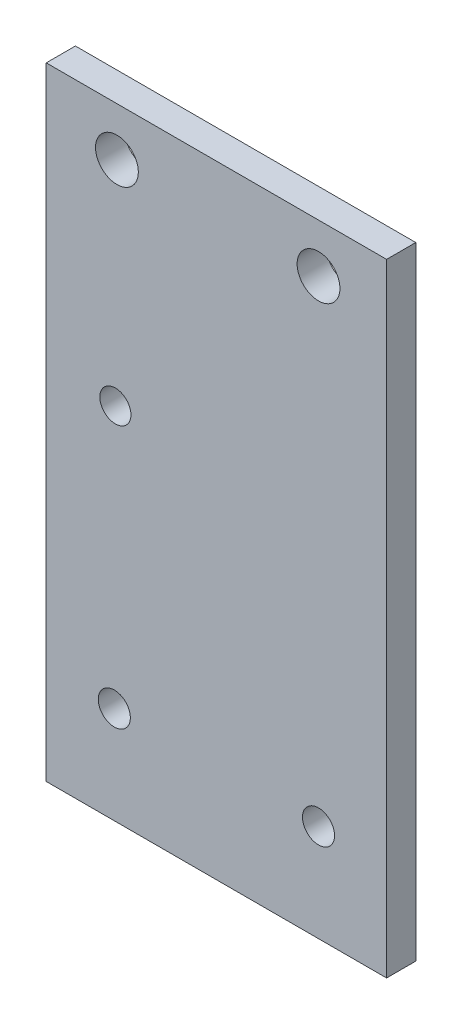
ISO-10303-21;
HEADER;
FILE_DESCRIPTION(('STEP AP214'),'2;1');
FILE_NAME('part.step','',(''),(''),'','','');
FILE_SCHEMA(('AUTOMOTIVE_DESIGN { 1 0 10303 214 1 1 1 1 }'));
ENDSEC;
DATA;
#1=APPLICATION_CONTEXT('core data for automotive mechanical design processes');
#2=APPLICATION_PROTOCOL_DEFINITION('international standard','automotive_design',2000,#1);
#3=PRODUCT_CONTEXT('',#1,'mechanical');
#4=PRODUCT('Part','Part','',(#3));
#5=PRODUCT_RELATED_PRODUCT_CATEGORY('part','',(#4));
#6=PRODUCT_DEFINITION_FORMATION('','',#4);
#7=PRODUCT_DEFINITION_CONTEXT('part definition',#1,'design');
#8=PRODUCT_DEFINITION('design','',#6,#7);
#9=PRODUCT_DEFINITION_SHAPE('','',#8);
#10=(LENGTH_UNIT() NAMED_UNIT(*) SI_UNIT(.MILLI.,.METRE.));
#11=(NAMED_UNIT(*) PLANE_ANGLE_UNIT() SI_UNIT($,.RADIAN.));
#12=(NAMED_UNIT(*) SI_UNIT($,.STERADIAN.) SOLID_ANGLE_UNIT());
#13=UNCERTAINTY_MEASURE_WITH_UNIT(LENGTH_MEASURE(1.E-05),#10,'distance_accuracy_value','');
#14=(GEOMETRIC_REPRESENTATION_CONTEXT(3) GLOBAL_UNCERTAINTY_ASSIGNED_CONTEXT((#13)) GLOBAL_UNIT_ASSIGNED_CONTEXT((#10,
#11,#12)) REPRESENTATION_CONTEXT('',''));
#15=CARTESIAN_POINT('',(0.,0.,0.));
#16=DIRECTION('',(0.,0.,1.));
#17=DIRECTION('',(1.,0.,0.));
#18=AXIS2_PLACEMENT_3D('',#15,#16,#17);
#19=CARTESIAN_POINT('',(0.,0.,0.));
#20=DIRECTION('',(0.,0.,1.));
#21=DIRECTION('',(1.,0.,0.));
#22=AXIS2_PLACEMENT_3D('',#19,#20,#21);
#23=PLANE('',#22);
#24=CARTESIAN_POINT('',(36.,-34.5,0.));
#25=DIRECTION('',(0.,0.,-1.));
#26=DIRECTION('',(-1.,0.,0.));
#27=AXIS2_PLACEMENT_3D('',#24,#25,#26);
#28=CIRCLE('',#27,1.64999999999998);
#29=CARTESIAN_POINT('',(34.35,-34.5,0.));
#30=VERTEX_POINT('',#29);
#31=EDGE_CURVE('E137',#30,#30,#28,.T.);
#32=ORIENTED_EDGE('',*,*,#31,.F.);
#33=EDGE_LOOP('',(#32));
#34=FACE_BOUND('',#33,.T.);
#35=DIRECTION('',(0.,-1.,0.));
#36=VECTOR('',#35,1.);
#37=CARTESIAN_POINT('',(29.,34.5,0.));
#38=LINE('',#37,#36);
#39=CARTESIAN_POINT('',(29.,19.5,0.));
#40=VERTEX_POINT('',#39);
#41=CARTESIAN_POINT('',(29.,-44.5,0.));
#42=VERTEX_POINT('',#41);
#43=EDGE_CURVE('E55',#40,#42,#38,.T.);
#44=ORIENTED_EDGE('',*,*,#43,.F.);
#45=DIRECTION('',(-1.,0.,0.));
#46=VECTOR('',#45,1.);
#47=CARTESIAN_POINT('',(29.,19.5,0.));
#48=LINE('',#47,#46);
#49=CARTESIAN_POINT('',(64.,19.5,0.));
#50=VERTEX_POINT('',#49);
#51=EDGE_CURVE('E48',#50,#40,#48,.T.);
#52=ORIENTED_EDGE('',*,*,#51,.F.);
#53=DIRECTION('',(0.,1.,0.));
#54=VECTOR('',#53,1.);
#55=CARTESIAN_POINT('',(64.,24.5,0.));
#56=LINE('',#55,#54);
#57=CARTESIAN_POINT('',(64.,-44.5,0.));
#58=VERTEX_POINT('',#57);
#59=EDGE_CURVE('E41',#58,#50,#56,.T.);
#60=ORIENTED_EDGE('',*,*,#59,.F.);
#61=DIRECTION('',(1.,0.,0.));
#62=VECTOR('',#61,1.);
#63=CARTESIAN_POINT('',(21.,-44.5,0.));
#64=LINE('',#63,#62);
#65=EDGE_CURVE('E112',#42,#58,#64,.T.);
#66=ORIENTED_EDGE('',*,*,#65,.F.);
#67=EDGE_LOOP('',(#44,#52,#60,#66));
#68=FACE_BOUND('',#67,.T.);
#69=CARTESIAN_POINT('',(36.11,-7.5,0.));
#70=DIRECTION('',(0.,0.,-1.));
#71=DIRECTION('',(-1.,0.,0.));
#72=AXIS2_PLACEMENT_3D('',#69,#70,#71);
#73=CIRCLE('',#72,1.6);
#74=CARTESIAN_POINT('',(34.51,-7.5,0.));
#75=VERTEX_POINT('',#74);
#76=EDGE_CURVE('E90',#75,#75,#73,.T.);
#77=ORIENTED_EDGE('',*,*,#76,.F.);
#78=EDGE_LOOP('',(#77));
#79=FACE_BOUND('',#78,.T.);
#80=CARTESIAN_POINT('',(36.27,14.5,0.));
#81=DIRECTION('',(0.,0.,-1.));
#82=DIRECTION('',(-1.,0.,0.));
#83=AXIS2_PLACEMENT_3D('',#80,#81,#82);
#84=CIRCLE('',#83,2.2);
#85=CARTESIAN_POINT('',(34.07,14.5,0.));
#86=VERTEX_POINT('',#85);
#87=EDGE_CURVE('E101',#86,#86,#84,.T.);
#88=ORIENTED_EDGE('',*,*,#87,.F.);
#89=EDGE_LOOP('',(#88));
#90=FACE_BOUND('',#89,.T.);
#91=CARTESIAN_POINT('',(57.0000000000001,14.5,0.));
#92=DIRECTION('',(0.,0.,-1.));
#93=DIRECTION('',(-1.,0.,0.));
#94=AXIS2_PLACEMENT_3D('',#91,#92,#93);
#95=CIRCLE('',#94,2.2);
#96=CARTESIAN_POINT('',(54.8000000000001,14.5,0.));
#97=VERTEX_POINT('',#96);
#98=EDGE_CURVE('E100',#97,#97,#95,.T.);
#99=ORIENTED_EDGE('',*,*,#98,.F.);
#100=EDGE_LOOP('',(#99));
#101=FACE_BOUND('',#100,.T.);
#102=CARTESIAN_POINT('',(57.,-34.5,0.));
#103=DIRECTION('',(0.,0.,-1.));
#104=DIRECTION('',(-1.,0.,0.));
#105=AXIS2_PLACEMENT_3D('',#102,#103,#104);
#106=CIRCLE('',#105,1.64999999999999);
#107=CARTESIAN_POINT('',(55.35,-34.5,0.));
#108=VERTEX_POINT('',#107);
#109=EDGE_CURVE('E131',#108,#108,#106,.T.);
#110=ORIENTED_EDGE('',*,*,#109,.F.);
#111=EDGE_LOOP('',(#110));
#112=FACE_BOUND('',#111,.T.);
#113=ADVANCED_FACE('F34',(#34,#68,#79,#90,#101,#112),#23,.F.);
#114=CARTESIAN_POINT('',(0.,0.,3.));
#115=DIRECTION('',(0.,0.,1.));
#116=DIRECTION('',(1.,0.,0.));
#117=AXIS2_PLACEMENT_3D('',#114,#115,#116);
#118=PLANE('',#117);
#119=CARTESIAN_POINT('',(36.,-34.5,3.));
#120=DIRECTION('',(0.,0.,-1.));
#121=DIRECTION('',(-1.,0.,0.));
#122=AXIS2_PLACEMENT_3D('',#119,#120,#121);
#123=CIRCLE('',#122,1.65);
#124=CARTESIAN_POINT('',(34.35,-34.5,3.));
#125=VERTEX_POINT('',#124);
#126=EDGE_CURVE('E134',#125,#125,#123,.T.);
#127=ORIENTED_EDGE('',*,*,#126,.T.);
#128=EDGE_LOOP('',(#127));
#129=FACE_BOUND('',#128,.T.);
#130=CARTESIAN_POINT('',(57.0000000000001,14.5,3.));
#131=DIRECTION('',(0.,0.,1.));
#132=DIRECTION('',(1.,0.,0.));
#133=AXIS2_PLACEMENT_3D('',#130,#131,#132);
#134=CIRCLE('',#133,2.2);
#135=CARTESIAN_POINT('',(59.2000000000001,14.5,3.));
#136=VERTEX_POINT('',#135);
#137=EDGE_CURVE('E104',#136,#136,#134,.T.);
#138=ORIENTED_EDGE('',*,*,#137,.F.);
#139=EDGE_LOOP('',(#138));
#140=FACE_BOUND('',#139,.T.);
#141=CARTESIAN_POINT('',(36.27,14.5,3.));
#142=DIRECTION('',(0.,0.,1.));
#143=DIRECTION('',(1.,0.,0.));
#144=AXIS2_PLACEMENT_3D('',#141,#142,#143);
#145=CIRCLE('',#144,2.2);
#146=CARTESIAN_POINT('',(38.47,14.5,3.));
#147=VERTEX_POINT('',#146);
#148=EDGE_CURVE('E109',#147,#147,#145,.T.);
#149=ORIENTED_EDGE('',*,*,#148,.F.);
#150=EDGE_LOOP('',(#149));
#151=FACE_BOUND('',#150,.T.);
#152=CARTESIAN_POINT('',(36.11,-7.5,3.));
#153=DIRECTION('',(0.,0.,1.));
#154=DIRECTION('',(1.,0.,0.));
#155=AXIS2_PLACEMENT_3D('',#152,#153,#154);
#156=CIRCLE('',#155,1.6);
#157=CARTESIAN_POINT('',(37.71,-7.5,3.));
#158=VERTEX_POINT('',#157);
#159=EDGE_CURVE('E93',#158,#158,#156,.T.);
#160=ORIENTED_EDGE('',*,*,#159,.F.);
#161=EDGE_LOOP('',(#160));
#162=FACE_BOUND('',#161,.T.);
#163=DIRECTION('',(1.,0.,0.));
#164=VECTOR('',#163,1.);
#165=CARTESIAN_POINT('',(29.,19.5,3.));
#166=LINE('',#165,#164);
#167=CARTESIAN_POINT('',(29.,19.5,3.));
#168=VERTEX_POINT('',#167);
#169=CARTESIAN_POINT('',(64.,19.5,3.));
#170=VERTEX_POINT('',#169);
#171=EDGE_CURVE('E73',#168,#170,#166,.T.);
#172=ORIENTED_EDGE('',*,*,#171,.F.);
#173=DIRECTION('',(0.,1.,0.));
#174=VECTOR('',#173,1.);
#175=CARTESIAN_POINT('',(29.,34.5,3.));
#176=LINE('',#175,#174);
#177=CARTESIAN_POINT('',(29.,-44.5,3.));
#178=VERTEX_POINT('',#177);
#179=EDGE_CURVE('E84',#178,#168,#176,.T.);
#180=ORIENTED_EDGE('',*,*,#179,.F.);
#181=DIRECTION('',(-1.,0.,0.));
#182=VECTOR('',#181,1.);
#183=CARTESIAN_POINT('',(21.,-44.5,3.));
#184=LINE('',#183,#182);
#185=CARTESIAN_POINT('',(64.,-44.5,3.));
#186=VERTEX_POINT('',#185);
#187=EDGE_CURVE('E117',#186,#178,#184,.T.);
#188=ORIENTED_EDGE('',*,*,#187,.F.);
#189=DIRECTION('',(0.,-1.,0.));
#190=VECTOR('',#189,1.);
#191=CARTESIAN_POINT('',(64.,24.5,3.));
#192=LINE('',#191,#190);
#193=EDGE_CURVE('E11',#170,#186,#192,.T.);
#194=ORIENTED_EDGE('',*,*,#193,.F.);
#195=EDGE_LOOP('',(#172,#180,#188,#194));
#196=FACE_BOUND('',#195,.T.);
#197=CARTESIAN_POINT('',(57.,-34.5,3.));
#198=DIRECTION('',(0.,0.,-1.));
#199=DIRECTION('',(-1.,0.,0.));
#200=AXIS2_PLACEMENT_3D('',#197,#198,#199);
#201=CIRCLE('',#200,1.65);
#202=CARTESIAN_POINT('',(55.35,-34.5,3.));
#203=VERTEX_POINT('',#202);
#204=EDGE_CURVE('E76',#203,#203,#201,.T.);
#205=ORIENTED_EDGE('',*,*,#204,.T.);
#206=EDGE_LOOP('',(#205));
#207=FACE_BOUND('',#206,.T.);
#208=ADVANCED_FACE('F81',(#129,#140,#151,#162,#196,#207),#118,.T.);
#209=CARTESIAN_POINT('',(0.,-44.5,0.));
#210=DIRECTION('',(0.,-1.,0.));
#211=DIRECTION('',(0.,0.,-1.));
#212=AXIS2_PLACEMENT_3D('',#209,#210,#211);
#213=PLANE('',#212);
#214=ORIENTED_EDGE('',*,*,#187,.T.);
#215=DIRECTION('',(0.,0.,1.));
#216=VECTOR('',#215,1.);
#217=CARTESIAN_POINT('',(29.,-44.5,0.));
#218=LINE('',#217,#216);
#219=EDGE_CURVE('E89',#42,#178,#218,.T.);
#220=ORIENTED_EDGE('',*,*,#219,.F.);
#221=ORIENTED_EDGE('',*,*,#65,.T.);
#222=DIRECTION('',(0.,0.,1.));
#223=VECTOR('',#222,1.);
#224=CARTESIAN_POINT('',(64.,-44.5,3.));
#225=LINE('',#224,#223);
#226=EDGE_CURVE('E114',#58,#186,#225,.T.);
#227=ORIENTED_EDGE('',*,*,#226,.T.);
#228=EDGE_LOOP('',(#214,#220,#221,#227));
#229=FACE_BOUND('',#228,.T.);
#230=ADVANCED_FACE('F147',(#229),#213,.T.);
#231=CARTESIAN_POINT('',(64.,0.,0.));
#232=DIRECTION('',(-1.,0.,0.));
#233=DIRECTION('',(0.,0.,1.));
#234=AXIS2_PLACEMENT_3D('',#231,#232,#233);
#235=PLANE('',#234);
#236=ORIENTED_EDGE('',*,*,#59,.T.);
#237=DIRECTION('',(0.,0.,-1.));
#238=VECTOR('',#237,1.);
#239=CARTESIAN_POINT('',(64.,19.5,3.));
#240=LINE('',#239,#238);
#241=EDGE_CURVE('E86',#170,#50,#240,.T.);
#242=ORIENTED_EDGE('',*,*,#241,.F.);
#243=ORIENTED_EDGE('',*,*,#193,.T.);
#244=ORIENTED_EDGE('',*,*,#226,.F.);
#245=EDGE_LOOP('',(#236,#242,#243,#244));
#246=FACE_BOUND('',#245,.T.);
#247=ADVANCED_FACE('F122',(#246),#235,.F.);
#248=CARTESIAN_POINT('',(57.0000000000001,14.5,30.));
#249=DIRECTION('',(0.,0.,-1.));
#250=DIRECTION('',(-1.,0.,0.));
#251=AXIS2_PLACEMENT_3D('',#248,#249,#250);
#252=CYLINDRICAL_SURFACE('',#251,2.2);
#253=ORIENTED_EDGE('',*,*,#137,.T.);
#254=EDGE_LOOP('',(#253));
#255=FACE_BOUND('',#254,.T.);
#256=ORIENTED_EDGE('',*,*,#98,.T.);
#257=EDGE_LOOP('',(#256));
#258=FACE_BOUND('',#257,.T.);
#259=ADVANCED_FACE('F157',(#255,#258),#252,.F.);
#260=CARTESIAN_POINT('',(36.27,14.5,30.));
#261=DIRECTION('',(0.,0.,-1.));
#262=DIRECTION('',(-1.,0.,0.));
#263=AXIS2_PLACEMENT_3D('',#260,#261,#262);
#264=CYLINDRICAL_SURFACE('',#263,2.2);
#265=ORIENTED_EDGE('',*,*,#148,.T.);
#266=EDGE_LOOP('',(#265));
#267=FACE_BOUND('',#266,.T.);
#268=ORIENTED_EDGE('',*,*,#87,.T.);
#269=EDGE_LOOP('',(#268));
#270=FACE_BOUND('',#269,.T.);
#271=ADVANCED_FACE('F161',(#267,#270),#264,.F.);
#272=CARTESIAN_POINT('',(36.11,-7.5,10.));
#273=DIRECTION('',(0.,0.,-1.));
#274=DIRECTION('',(-1.,0.,0.));
#275=AXIS2_PLACEMENT_3D('',#272,#273,#274);
#276=CYLINDRICAL_SURFACE('',#275,1.6);
#277=ORIENTED_EDGE('',*,*,#159,.T.);
#278=EDGE_LOOP('',(#277));
#279=FACE_BOUND('',#278,.T.);
#280=ORIENTED_EDGE('',*,*,#76,.T.);
#281=EDGE_LOOP('',(#280));
#282=FACE_BOUND('',#281,.T.);
#283=ADVANCED_FACE('F165',(#279,#282),#276,.F.);
#284=CARTESIAN_POINT('',(29.,0.,0.));
#285=DIRECTION('',(-1.,0.,0.));
#286=DIRECTION('',(0.,-1.,0.));
#287=AXIS2_PLACEMENT_3D('',#284,#285,#286);
#288=PLANE('',#287);
#289=DIRECTION('',(0.,0.,1.));
#290=VECTOR('',#289,1.);
#291=CARTESIAN_POINT('',(29.,19.5,3.));
#292=LINE('',#291,#290);
#293=EDGE_CURVE('E70',#40,#168,#292,.T.);
#294=ORIENTED_EDGE('',*,*,#293,.F.);
#295=ORIENTED_EDGE('',*,*,#43,.T.);
#296=ORIENTED_EDGE('',*,*,#219,.T.);
#297=ORIENTED_EDGE('',*,*,#179,.T.);
#298=EDGE_LOOP('',(#294,#295,#296,#297));
#299=FACE_BOUND('',#298,.T.);
#300=ADVANCED_FACE('F88',(#299),#288,.T.);
#301=CARTESIAN_POINT('',(0.,19.5,0.));
#302=DIRECTION('',(0.,-1.,0.));
#303=DIRECTION('',(0.,0.,-1.));
#304=AXIS2_PLACEMENT_3D('',#301,#302,#303);
#305=PLANE('',#304);
#306=ORIENTED_EDGE('',*,*,#293,.T.);
#307=ORIENTED_EDGE('',*,*,#171,.T.);
#308=ORIENTED_EDGE('',*,*,#241,.T.);
#309=ORIENTED_EDGE('',*,*,#51,.T.);
#310=EDGE_LOOP('',(#306,#307,#308,#309));
#311=FACE_BOUND('',#310,.T.);
#312=ADVANCED_FACE('F72',(#311),#305,.F.);
#313=CARTESIAN_POINT('',(57.,-34.5,0.));
#314=DIRECTION('',(0.,0.,-1.));
#315=DIRECTION('',(-1.,0.,0.));
#316=AXIS2_PLACEMENT_3D('',#313,#314,#315);
#317=CYLINDRICAL_SURFACE('',#316,1.65);
#318=ORIENTED_EDGE('',*,*,#204,.F.);
#319=EDGE_LOOP('',(#318));
#320=FACE_BOUND('',#319,.T.);
#321=ORIENTED_EDGE('',*,*,#109,.T.);
#322=EDGE_LOOP('',(#321));
#323=FACE_BOUND('',#322,.T.);
#324=ADVANCED_FACE('F174',(#320,#323),#317,.F.);
#325=CARTESIAN_POINT('',(36.,-34.5,0.));
#326=DIRECTION('',(0.,0.,-1.));
#327=DIRECTION('',(-1.,0.,0.));
#328=AXIS2_PLACEMENT_3D('',#325,#326,#327);
#329=CYLINDRICAL_SURFACE('',#328,1.64999999999999);
#330=ORIENTED_EDGE('',*,*,#126,.F.);
#331=EDGE_LOOP('',(#330));
#332=FACE_BOUND('',#331,.T.);
#333=ORIENTED_EDGE('',*,*,#31,.T.);
#334=EDGE_LOOP('',(#333));
#335=FACE_BOUND('',#334,.T.);
#336=ADVANCED_FACE('F141',(#332,#335),#329,.F.);
#337=CLOSED_SHELL('',(#113,#208,#230,#247,#259,#271,#283,#300,#312,#324,#336));
#338=MANIFOLD_SOLID_BREP('B2',#337);
#339=ADVANCED_BREP_SHAPE_REPRESENTATION('',(#18,#338),#14);
#340=SHAPE_DEFINITION_REPRESENTATION(#9,#339);
ENDSEC;
END-ISO-10303-21;
